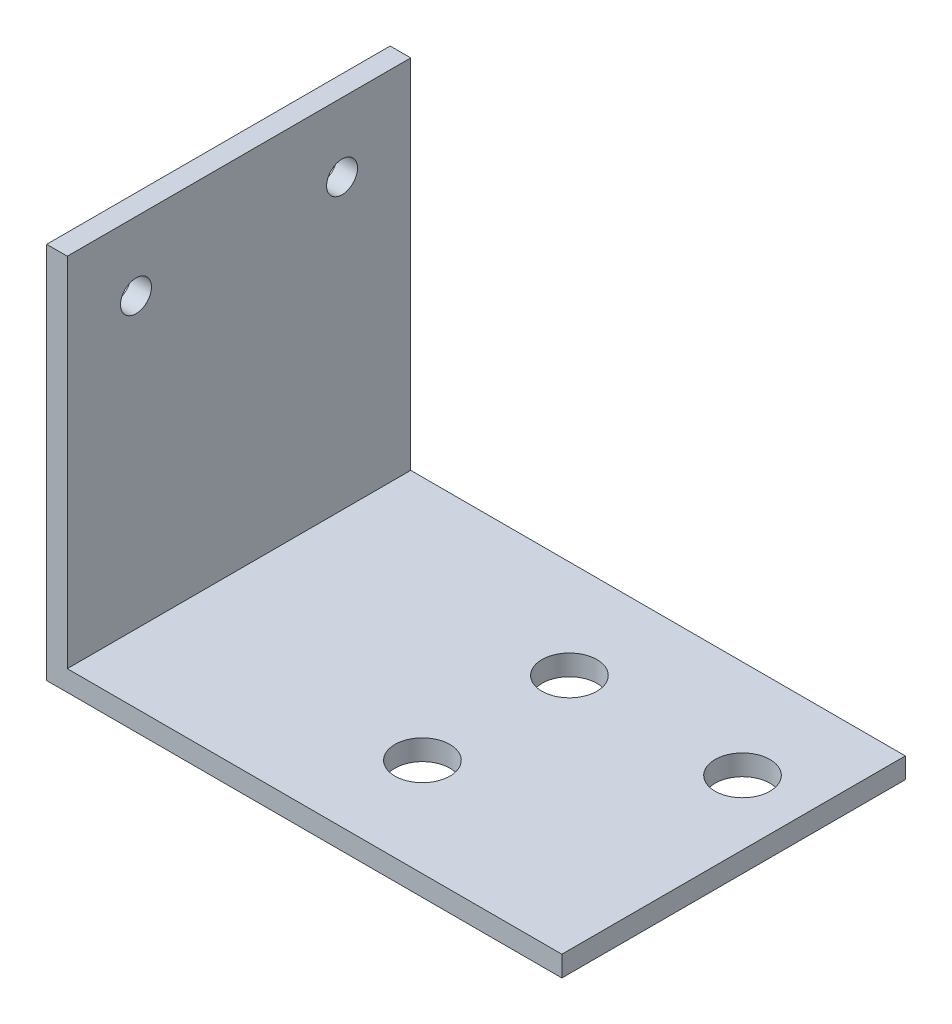
ISO-10303-21;
HEADER;
FILE_DESCRIPTION(('STEP AP214'),'2;1');
FILE_NAME('part.step','',(''),(''),'','','');
FILE_SCHEMA(('AUTOMOTIVE_DESIGN { 1 0 10303 214 1 1 1 1 }'));
ENDSEC;
DATA;
#1=APPLICATION_CONTEXT('core data for automotive mechanical design processes');
#2=APPLICATION_PROTOCOL_DEFINITION('international standard','automotive_design',2000,#1);
#3=PRODUCT_CONTEXT('',#1,'mechanical');
#4=PRODUCT('Part','Part','',(#3));
#5=PRODUCT_RELATED_PRODUCT_CATEGORY('part','',(#4));
#6=PRODUCT_DEFINITION_FORMATION('','',#4);
#7=PRODUCT_DEFINITION_CONTEXT('part definition',#1,'design');
#8=PRODUCT_DEFINITION('design','',#6,#7);
#9=PRODUCT_DEFINITION_SHAPE('','',#8);
#10=(LENGTH_UNIT() NAMED_UNIT(*) SI_UNIT(.MILLI.,.METRE.));
#11=(NAMED_UNIT(*) PLANE_ANGLE_UNIT() SI_UNIT($,.RADIAN.));
#12=(NAMED_UNIT(*) SI_UNIT($,.STERADIAN.) SOLID_ANGLE_UNIT());
#13=UNCERTAINTY_MEASURE_WITH_UNIT(LENGTH_MEASURE(1.E-05),#10,'distance_accuracy_value','');
#14=(GEOMETRIC_REPRESENTATION_CONTEXT(3) GLOBAL_UNCERTAINTY_ASSIGNED_CONTEXT((#13)) GLOBAL_UNIT_ASSIGNED_CONTEXT((#10,
#11,#12)) REPRESENTATION_CONTEXT('',''));
#15=CARTESIAN_POINT('',(0.,0.,0.));
#16=DIRECTION('',(0.,0.,1.));
#17=DIRECTION('',(1.,0.,0.));
#18=AXIS2_PLACEMENT_3D('',#15,#16,#17);
#19=CARTESIAN_POINT('',(0.,55.,50.));
#20=DIRECTION('',(1.,0.,0.));
#21=DIRECTION('',(0.,0.,-1.));
#22=AXIS2_PLACEMENT_3D('',#19,#20,#21);
#23=PLANE('',#22);
#24=CARTESIAN_POINT('',(0.,45.,40.));
#25=DIRECTION('',(-1.,0.,0.));
#26=DIRECTION('',(0.,0.,1.));
#27=AXIS2_PLACEMENT_3D('',#24,#25,#26);
#28=CIRCLE('',#27,2.25);
#29=CARTESIAN_POINT('',(0.,45.,42.25));
#30=VERTEX_POINT('',#29);
#31=EDGE_CURVE('E151',#30,#30,#28,.T.);
#32=ORIENTED_EDGE('',*,*,#31,.F.);
#33=EDGE_LOOP('',(#32));
#34=FACE_BOUND('',#33,.T.);
#35=CARTESIAN_POINT('',(0.,45.,10.));
#36=DIRECTION('',(-1.,0.,0.));
#37=DIRECTION('',(0.,0.,1.));
#38=AXIS2_PLACEMENT_3D('',#35,#36,#37);
#39=CIRCLE('',#38,2.25);
#40=CARTESIAN_POINT('',(0.,45.,12.25));
#41=VERTEX_POINT('',#40);
#42=EDGE_CURVE('E140',#41,#41,#39,.T.);
#43=ORIENTED_EDGE('',*,*,#42,.F.);
#44=EDGE_LOOP('',(#43));
#45=FACE_BOUND('',#44,.T.);
#46=DIRECTION('',(0.,-1.,0.));
#47=VECTOR('',#46,1.);
#48=CARTESIAN_POINT('',(0.,55.,0.));
#49=LINE('',#48,#47);
#50=CARTESIAN_POINT('',(0.,55.,0.));
#51=VERTEX_POINT('',#50);
#52=CARTESIAN_POINT('',(0.,0.,0.));
#53=VERTEX_POINT('',#52);
#54=EDGE_CURVE('E121',#51,#53,#49,.T.);
#55=ORIENTED_EDGE('',*,*,#54,.T.);
#56=DIRECTION('',(0.,0.,-1.));
#57=VECTOR('',#56,1.);
#58=CARTESIAN_POINT('',(0.,0.,50.));
#59=LINE('',#58,#57);
#60=CARTESIAN_POINT('',(0.,0.,50.));
#61=VERTEX_POINT('',#60);
#62=EDGE_CURVE('E11',#61,#53,#59,.T.);
#63=ORIENTED_EDGE('',*,*,#62,.F.);
#64=DIRECTION('',(0.,-1.,0.));
#65=VECTOR('',#64,1.);
#66=CARTESIAN_POINT('',(0.,55.,50.));
#67=LINE('',#66,#65);
#68=CARTESIAN_POINT('',(0.,55.,50.));
#69=VERTEX_POINT('',#68);
#70=EDGE_CURVE('E132',#69,#61,#67,.T.);
#71=ORIENTED_EDGE('',*,*,#70,.F.);
#72=DIRECTION('',(0.,0.,-1.));
#73=VECTOR('',#72,1.);
#74=CARTESIAN_POINT('',(0.,55.,50.));
#75=LINE('',#74,#73);
#76=EDGE_CURVE('E117',#69,#51,#75,.T.);
#77=ORIENTED_EDGE('',*,*,#76,.T.);
#78=EDGE_LOOP('',(#55,#63,#71,#77));
#79=FACE_BOUND('',#78,.T.);
#80=ADVANCED_FACE('F35',(#34,#45,#79),#23,.F.);
#81=CARTESIAN_POINT('',(0.,0.,50.));
#82=DIRECTION('',(0.,1.,0.));
#83=DIRECTION('',(0.,0.,1.));
#84=AXIS2_PLACEMENT_3D('',#81,#82,#83);
#85=PLANE('',#84);
#86=CARTESIAN_POINT('',(40.4000000000003,0.,35.7));
#87=DIRECTION('',(0.,1.,0.));
#88=DIRECTION('',(-1.,0.,0.));
#89=AXIS2_PLACEMENT_3D('',#86,#87,#88);
#90=CIRCLE('',#89,4.00000000000001);
#91=CARTESIAN_POINT('',(36.4000000000003,0.,35.7));
#92=VERTEX_POINT('',#91);
#93=EDGE_CURVE('E144',#92,#92,#90,.T.);
#94=ORIENTED_EDGE('',*,*,#93,.T.);
#95=EDGE_LOOP('',(#94));
#96=FACE_BOUND('',#95,.T.);
#97=CARTESIAN_POINT('',(65.6000000000003,0.,14.3));
#98=DIRECTION('',(0.,1.,0.));
#99=DIRECTION('',(-1.,0.,0.));
#100=AXIS2_PLACEMENT_3D('',#97,#98,#99);
#101=CIRCLE('',#100,4.00000000000001);
#102=CARTESIAN_POINT('',(61.6000000000003,0.,14.3));
#103=VERTEX_POINT('',#102);
#104=EDGE_CURVE('E157',#103,#103,#101,.T.);
#105=ORIENTED_EDGE('',*,*,#104,.T.);
#106=EDGE_LOOP('',(#105));
#107=FACE_BOUND('',#106,.T.);
#108=CARTESIAN_POINT('',(40.4000000000003,0.,14.3));
#109=DIRECTION('',(0.,1.,0.));
#110=DIRECTION('',(-1.,0.,0.));
#111=AXIS2_PLACEMENT_3D('',#108,#109,#110);
#112=CIRCLE('',#111,4.00000000000001);
#113=CARTESIAN_POINT('',(36.4000000000003,0.,14.3));
#114=VERTEX_POINT('',#113);
#115=EDGE_CURVE('E125',#114,#114,#112,.T.);
#116=ORIENTED_EDGE('',*,*,#115,.T.);
#117=EDGE_LOOP('',(#116));
#118=FACE_BOUND('',#117,.T.);
#119=DIRECTION('',(1.,0.,0.));
#120=VECTOR('',#119,1.);
#121=CARTESIAN_POINT('',(0.,0.,0.));
#122=LINE('',#121,#120);
#123=CARTESIAN_POINT('',(75.,0.,0.));
#124=VERTEX_POINT('',#123);
#125=EDGE_CURVE('E124',#53,#124,#122,.T.);
#126=ORIENTED_EDGE('',*,*,#125,.T.);
#127=DIRECTION('',(0.,0.,-1.));
#128=VECTOR('',#127,1.);
#129=CARTESIAN_POINT('',(75.,0.,50.));
#130=LINE('',#129,#128);
#131=CARTESIAN_POINT('',(75.,0.,50.));
#132=VERTEX_POINT('',#131);
#133=EDGE_CURVE('E44',#132,#124,#130,.T.);
#134=ORIENTED_EDGE('',*,*,#133,.F.);
#135=DIRECTION('',(1.,0.,0.));
#136=VECTOR('',#135,1.);
#137=CARTESIAN_POINT('',(0.,0.,50.));
#138=LINE('',#137,#136);
#139=EDGE_CURVE('E90',#61,#132,#138,.T.);
#140=ORIENTED_EDGE('',*,*,#139,.F.);
#141=ORIENTED_EDGE('',*,*,#62,.T.);
#142=EDGE_LOOP('',(#126,#134,#140,#141));
#143=FACE_BOUND('',#142,.T.);
#144=ADVANCED_FACE('F170',(#96,#107,#118,#143),#85,.F.);
#145=CARTESIAN_POINT('',(75.,0.,50.));
#146=DIRECTION('',(-1.,0.,0.));
#147=DIRECTION('',(0.,0.,1.));
#148=AXIS2_PLACEMENT_3D('',#145,#146,#147);
#149=PLANE('',#148);
#150=DIRECTION('',(0.,1.,0.));
#151=VECTOR('',#150,1.);
#152=CARTESIAN_POINT('',(75.,0.,0.));
#153=LINE('',#152,#151);
#154=CARTESIAN_POINT('',(75.,3.,0.));
#155=VERTEX_POINT('',#154);
#156=EDGE_CURVE('E127',#124,#155,#153,.T.);
#157=ORIENTED_EDGE('',*,*,#156,.T.);
#158=DIRECTION('',(0.,0.,-1.));
#159=VECTOR('',#158,1.);
#160=CARTESIAN_POINT('',(75.,3.,50.));
#161=LINE('',#160,#159);
#162=CARTESIAN_POINT('',(75.,3.,50.));
#163=VERTEX_POINT('',#162);
#164=EDGE_CURVE('E112',#163,#155,#161,.T.);
#165=ORIENTED_EDGE('',*,*,#164,.F.);
#166=DIRECTION('',(0.,1.,0.));
#167=VECTOR('',#166,1.);
#168=CARTESIAN_POINT('',(75.,0.,50.));
#169=LINE('',#168,#167);
#170=EDGE_CURVE('E103',#132,#163,#169,.T.);
#171=ORIENTED_EDGE('',*,*,#170,.F.);
#172=ORIENTED_EDGE('',*,*,#133,.T.);
#173=EDGE_LOOP('',(#157,#165,#171,#172));
#174=FACE_BOUND('',#173,.T.);
#175=ADVANCED_FACE('F173',(#174),#149,.F.);
#176=CARTESIAN_POINT('',(75.,3.,50.));
#177=DIRECTION('',(0.,-1.,0.));
#178=DIRECTION('',(1.,0.,0.));
#179=AXIS2_PLACEMENT_3D('',#176,#177,#178);
#180=PLANE('',#179);
#181=CARTESIAN_POINT('',(40.4000000000003,3.,35.7));
#182=DIRECTION('',(0.,1.,0.));
#183=DIRECTION('',(-1.,0.,0.));
#184=AXIS2_PLACEMENT_3D('',#181,#182,#183);
#185=CIRCLE('',#184,4.00000000000001);
#186=CARTESIAN_POINT('',(36.4000000000003,3.,35.7));
#187=VERTEX_POINT('',#186);
#188=EDGE_CURVE('E139',#187,#187,#185,.T.);
#189=ORIENTED_EDGE('',*,*,#188,.F.);
#190=EDGE_LOOP('',(#189));
#191=FACE_BOUND('',#190,.T.);
#192=CARTESIAN_POINT('',(65.6000000000003,3.,14.3));
#193=DIRECTION('',(0.,1.,0.));
#194=DIRECTION('',(-1.,0.,0.));
#195=AXIS2_PLACEMENT_3D('',#192,#193,#194);
#196=CIRCLE('',#195,4.00000000000001);
#197=CARTESIAN_POINT('',(61.6000000000003,3.,14.3));
#198=VERTEX_POINT('',#197);
#199=EDGE_CURVE('E155',#198,#198,#196,.T.);
#200=ORIENTED_EDGE('',*,*,#199,.F.);
#201=EDGE_LOOP('',(#200));
#202=FACE_BOUND('',#201,.T.);
#203=CARTESIAN_POINT('',(40.4000000000003,3.,14.3));
#204=DIRECTION('',(0.,1.,0.));
#205=DIRECTION('',(-1.,0.,0.));
#206=AXIS2_PLACEMENT_3D('',#203,#204,#205);
#207=CIRCLE('',#206,4.00000000000001);
#208=CARTESIAN_POINT('',(36.4000000000003,3.,14.3));
#209=VERTEX_POINT('',#208);
#210=EDGE_CURVE('E160',#209,#209,#207,.T.);
#211=ORIENTED_EDGE('',*,*,#210,.F.);
#212=EDGE_LOOP('',(#211));
#213=FACE_BOUND('',#212,.T.);
#214=DIRECTION('',(-1.,0.,0.));
#215=VECTOR('',#214,1.);
#216=CARTESIAN_POINT('',(75.,3.,0.));
#217=LINE('',#216,#215);
#218=CARTESIAN_POINT('',(3.,2.99999999999999,0.));
#219=VERTEX_POINT('',#218);
#220=EDGE_CURVE('E111',#155,#219,#217,.T.);
#221=ORIENTED_EDGE('',*,*,#220,.T.);
#222=DIRECTION('',(0.,0.,-1.));
#223=VECTOR('',#222,1.);
#224=CARTESIAN_POINT('',(3.,2.99999999999999,50.));
#225=LINE('',#224,#223);
#226=CARTESIAN_POINT('',(3.,2.99999999999999,50.));
#227=VERTEX_POINT('',#226);
#228=EDGE_CURVE('E108',#227,#219,#225,.T.);
#229=ORIENTED_EDGE('',*,*,#228,.F.);
#230=DIRECTION('',(-1.,0.,0.));
#231=VECTOR('',#230,1.);
#232=CARTESIAN_POINT('',(75.,3.,50.));
#233=LINE('',#232,#231);
#234=EDGE_CURVE('E97',#163,#227,#233,.T.);
#235=ORIENTED_EDGE('',*,*,#234,.F.);
#236=ORIENTED_EDGE('',*,*,#164,.T.);
#237=EDGE_LOOP('',(#221,#229,#235,#236));
#238=FACE_BOUND('',#237,.T.);
#239=ADVANCED_FACE('F109',(#191,#202,#213,#238),#180,.F.);
#240=CARTESIAN_POINT('',(3.,2.99999999999999,50.));
#241=DIRECTION('',(-1.,0.,0.));
#242=DIRECTION('',(0.,0.,1.));
#243=AXIS2_PLACEMENT_3D('',#240,#241,#242);
#244=PLANE('',#243);
#245=CARTESIAN_POINT('',(3.,45.,40.));
#246=DIRECTION('',(-1.,0.,0.));
#247=DIRECTION('',(0.,0.,1.));
#248=AXIS2_PLACEMENT_3D('',#245,#246,#247);
#249=CIRCLE('',#248,2.25);
#250=CARTESIAN_POINT('',(3.,45.,42.25));
#251=VERTEX_POINT('',#250);
#252=EDGE_CURVE('E38',#251,#251,#249,.T.);
#253=ORIENTED_EDGE('',*,*,#252,.T.);
#254=EDGE_LOOP('',(#253));
#255=FACE_BOUND('',#254,.T.);
#256=CARTESIAN_POINT('',(3.,45.,10.));
#257=DIRECTION('',(-1.,0.,0.));
#258=DIRECTION('',(0.,0.,1.));
#259=AXIS2_PLACEMENT_3D('',#256,#257,#258);
#260=CIRCLE('',#259,2.25);
#261=CARTESIAN_POINT('',(3.,45.,12.25));
#262=VERTEX_POINT('',#261);
#263=EDGE_CURVE('E137',#262,#262,#260,.T.);
#264=ORIENTED_EDGE('',*,*,#263,.T.);
#265=EDGE_LOOP('',(#264));
#266=FACE_BOUND('',#265,.T.);
#267=DIRECTION('',(0.,1.,0.));
#268=VECTOR('',#267,1.);
#269=CARTESIAN_POINT('',(3.,2.99999999999999,0.));
#270=LINE('',#269,#268);
#271=CARTESIAN_POINT('',(3.,55.,0.));
#272=VERTEX_POINT('',#271);
#273=EDGE_CURVE('E76',#219,#272,#270,.T.);
#274=ORIENTED_EDGE('',*,*,#273,.T.);
#275=DIRECTION('',(0.,0.,-1.));
#276=VECTOR('',#275,1.);
#277=CARTESIAN_POINT('',(3.,55.,50.));
#278=LINE('',#277,#276);
#279=CARTESIAN_POINT('',(3.,55.,50.));
#280=VERTEX_POINT('',#279);
#281=EDGE_CURVE('E113',#280,#272,#278,.T.);
#282=ORIENTED_EDGE('',*,*,#281,.F.);
#283=DIRECTION('',(0.,1.,0.));
#284=VECTOR('',#283,1.);
#285=CARTESIAN_POINT('',(3.,2.99999999999999,50.));
#286=LINE('',#285,#284);
#287=EDGE_CURVE('E101',#227,#280,#286,.T.);
#288=ORIENTED_EDGE('',*,*,#287,.F.);
#289=ORIENTED_EDGE('',*,*,#228,.T.);
#290=EDGE_LOOP('',(#274,#282,#288,#289));
#291=FACE_BOUND('',#290,.T.);
#292=ADVANCED_FACE('F115',(#255,#266,#291),#244,.F.);
#293=CARTESIAN_POINT('',(3.,55.,50.));
#294=DIRECTION('',(0.,-1.,0.));
#295=DIRECTION('',(0.,0.,-1.));
#296=AXIS2_PLACEMENT_3D('',#293,#294,#295);
#297=PLANE('',#296);
#298=DIRECTION('',(-1.,0.,0.));
#299=VECTOR('',#298,1.);
#300=CARTESIAN_POINT('',(3.,55.,0.));
#301=LINE('',#300,#299);
#302=EDGE_CURVE('E82',#272,#51,#301,.T.);
#303=ORIENTED_EDGE('',*,*,#302,.T.);
#304=ORIENTED_EDGE('',*,*,#76,.F.);
#305=DIRECTION('',(-1.,0.,0.));
#306=VECTOR('',#305,1.);
#307=CARTESIAN_POINT('',(3.,55.,50.));
#308=LINE('',#307,#306);
#309=EDGE_CURVE('E53',#280,#69,#308,.T.);
#310=ORIENTED_EDGE('',*,*,#309,.F.);
#311=ORIENTED_EDGE('',*,*,#281,.T.);
#312=EDGE_LOOP('',(#303,#304,#310,#311));
#313=FACE_BOUND('',#312,.T.);
#314=ADVANCED_FACE('F178',(#313),#297,.F.);
#315=CARTESIAN_POINT('',(0.,0.,50.));
#316=DIRECTION('',(0.,0.,1.));
#317=DIRECTION('',(1.,0.,0.));
#318=AXIS2_PLACEMENT_3D('',#315,#316,#317);
#319=PLANE('',#318);
#320=ORIENTED_EDGE('',*,*,#70,.T.);
#321=ORIENTED_EDGE('',*,*,#139,.T.);
#322=ORIENTED_EDGE('',*,*,#170,.T.);
#323=ORIENTED_EDGE('',*,*,#234,.T.);
#324=ORIENTED_EDGE('',*,*,#287,.T.);
#325=ORIENTED_EDGE('',*,*,#309,.T.);
#326=EDGE_LOOP('',(#320,#321,#322,#323,#324,#325));
#327=FACE_BOUND('',#326,.T.);
#328=ADVANCED_FACE('F99',(#327),#319,.T.);
#329=CARTESIAN_POINT('',(0.,0.,0.));
#330=DIRECTION('',(0.,0.,1.));
#331=DIRECTION('',(1.,0.,0.));
#332=AXIS2_PLACEMENT_3D('',#329,#330,#331);
#333=PLANE('',#332);
#334=ORIENTED_EDGE('',*,*,#54,.F.);
#335=ORIENTED_EDGE('',*,*,#302,.F.);
#336=ORIENTED_EDGE('',*,*,#273,.F.);
#337=ORIENTED_EDGE('',*,*,#220,.F.);
#338=ORIENTED_EDGE('',*,*,#156,.F.);
#339=ORIENTED_EDGE('',*,*,#125,.F.);
#340=EDGE_LOOP('',(#334,#335,#336,#337,#338,#339));
#341=FACE_BOUND('',#340,.T.);
#342=ADVANCED_FACE('F176',(#341),#333,.F.);
#343=CARTESIAN_POINT('',(40.4000000000003,0.,14.3));
#344=DIRECTION('',(0.,1.,0.));
#345=DIRECTION('',(-1.,0.,0.));
#346=AXIS2_PLACEMENT_3D('',#343,#344,#345);
#347=CYLINDRICAL_SURFACE('',#346,4.00000000000001);
#348=ORIENTED_EDGE('',*,*,#115,.F.);
#349=EDGE_LOOP('',(#348));
#350=FACE_BOUND('',#349,.T.);
#351=ORIENTED_EDGE('',*,*,#210,.T.);
#352=EDGE_LOOP('',(#351));
#353=FACE_BOUND('',#352,.T.);
#354=ADVANCED_FACE('F217',(#350,#353),#347,.F.);
#355=CARTESIAN_POINT('',(65.6000000000003,0.,14.3));
#356=DIRECTION('',(0.,1.,0.));
#357=DIRECTION('',(-1.,0.,0.));
#358=AXIS2_PLACEMENT_3D('',#355,#356,#357);
#359=CYLINDRICAL_SURFACE('',#358,4.00000000000001);
#360=ORIENTED_EDGE('',*,*,#104,.F.);
#361=EDGE_LOOP('',(#360));
#362=FACE_BOUND('',#361,.T.);
#363=ORIENTED_EDGE('',*,*,#199,.T.);
#364=EDGE_LOOP('',(#363));
#365=FACE_BOUND('',#364,.T.);
#366=ADVANCED_FACE('F213',(#362,#365),#359,.F.);
#367=CARTESIAN_POINT('',(40.4000000000003,0.,35.7));
#368=DIRECTION('',(0.,1.,0.));
#369=DIRECTION('',(-1.,0.,0.));
#370=AXIS2_PLACEMENT_3D('',#367,#368,#369);
#371=CYLINDRICAL_SURFACE('',#370,4.00000000000001);
#372=ORIENTED_EDGE('',*,*,#93,.F.);
#373=EDGE_LOOP('',(#372));
#374=FACE_BOUND('',#373,.T.);
#375=ORIENTED_EDGE('',*,*,#188,.T.);
#376=EDGE_LOOP('',(#375));
#377=FACE_BOUND('',#376,.T.);
#378=ADVANCED_FACE('F208',(#374,#377),#371,.F.);
#379=CARTESIAN_POINT('',(75.,45.,10.));
#380=DIRECTION('',(-1.,0.,0.));
#381=DIRECTION('',(0.,0.,1.));
#382=AXIS2_PLACEMENT_3D('',#379,#380,#381);
#383=CYLINDRICAL_SURFACE('',#382,2.25);
#384=ORIENTED_EDGE('',*,*,#42,.T.);
#385=EDGE_LOOP('',(#384));
#386=FACE_BOUND('',#385,.T.);
#387=ORIENTED_EDGE('',*,*,#263,.F.);
#388=EDGE_LOOP('',(#387));
#389=FACE_BOUND('',#388,.T.);
#390=ADVANCED_FACE('F202',(#386,#389),#383,.F.);
#391=CARTESIAN_POINT('',(75.,45.,40.));
#392=DIRECTION('',(-1.,0.,0.));
#393=DIRECTION('',(0.,0.,1.));
#394=AXIS2_PLACEMENT_3D('',#391,#392,#393);
#395=CYLINDRICAL_SURFACE('',#394,2.25);
#396=ORIENTED_EDGE('',*,*,#31,.T.);
#397=EDGE_LOOP('',(#396));
#398=FACE_BOUND('',#397,.T.);
#399=ORIENTED_EDGE('',*,*,#252,.F.);
#400=EDGE_LOOP('',(#399));
#401=FACE_BOUND('',#400,.T.);
#402=ADVANCED_FACE('F199',(#398,#401),#395,.F.);
#403=CLOSED_SHELL('',(#80,#144,#175,#239,#292,#314,#328,#342,#354,#366,#378,#390,#402));
#404=MANIFOLD_SOLID_BREP('B2',#403);
#405=ADVANCED_BREP_SHAPE_REPRESENTATION('',(#18,#404),#14);
#406=SHAPE_DEFINITION_REPRESENTATION(#9,#405);
ENDSEC;
END-ISO-10303-21;
